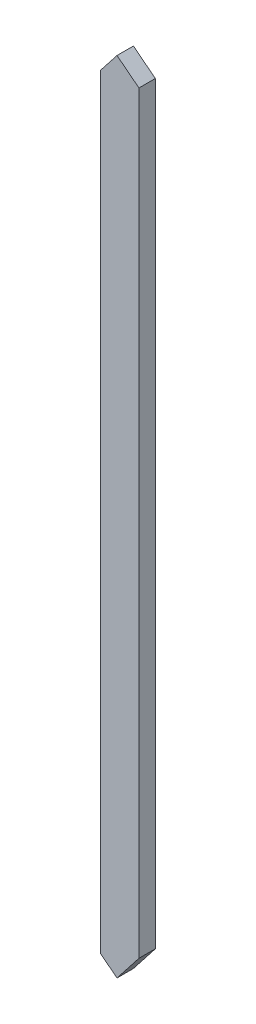
ISO-10303-21;
HEADER;
FILE_DESCRIPTION(('STEP AP214'),'2;1');
FILE_NAME('part.step','',(''),(''),'','','');
FILE_SCHEMA(('AUTOMOTIVE_DESIGN { 1 0 10303 214 1 1 1 1 }'));
ENDSEC;
DATA;
#1=APPLICATION_CONTEXT('core data for automotive mechanical design processes');
#2=APPLICATION_PROTOCOL_DEFINITION('international standard','automotive_design',2000,#1);
#3=PRODUCT_CONTEXT('',#1,'mechanical');
#4=PRODUCT('Part','Part','',(#3));
#5=PRODUCT_RELATED_PRODUCT_CATEGORY('part','',(#4));
#6=PRODUCT_DEFINITION_FORMATION('','',#4);
#7=PRODUCT_DEFINITION_CONTEXT('part definition',#1,'design');
#8=PRODUCT_DEFINITION('design','',#6,#7);
#9=PRODUCT_DEFINITION_SHAPE('','',#8);
#10=(LENGTH_UNIT() NAMED_UNIT(*) SI_UNIT(.MILLI.,.METRE.));
#11=(NAMED_UNIT(*) PLANE_ANGLE_UNIT() SI_UNIT($,.RADIAN.));
#12=(NAMED_UNIT(*) SI_UNIT($,.STERADIAN.) SOLID_ANGLE_UNIT());
#13=UNCERTAINTY_MEASURE_WITH_UNIT(LENGTH_MEASURE(1.E-05),#10,'distance_accuracy_value','');
#14=(GEOMETRIC_REPRESENTATION_CONTEXT(3) GLOBAL_UNCERTAINTY_ASSIGNED_CONTEXT((#13)) GLOBAL_UNIT_ASSIGNED_CONTEXT((#10,
#11,#12)) REPRESENTATION_CONTEXT('',''));
#15=CARTESIAN_POINT('',(0.,0.,0.));
#16=DIRECTION('',(0.,0.,1.));
#17=DIRECTION('',(1.,0.,0.));
#18=AXIS2_PLACEMENT_3D('',#15,#16,#17);
#19=CARTESIAN_POINT('',(-44.45,2032.,19.05));
#20=DIRECTION('',(-1.,0.,0.));
#21=DIRECTION('',(0.,0.,1.));
#22=AXIS2_PLACEMENT_3D('',#19,#20,#21);
#23=PLANE('',#22);
#24=DIRECTION('',(0.,0.,1.));
#25=VECTOR('',#24,1.);
#26=CARTESIAN_POINT('',(-44.4499999999999,29.7359069157097,-19.05));
#27=LINE('',#26,#25);
#28=CARTESIAN_POINT('',(-44.4499999999999,29.7359069157097,-19.05));
#29=VERTEX_POINT('',#28);
#30=CARTESIAN_POINT('',(-44.4499999999999,29.7359069157097,19.05));
#31=VERTEX_POINT('',#30);
#32=EDGE_CURVE('E133',#29,#31,#27,.T.);
#33=ORIENTED_EDGE('',*,*,#32,.T.);
#34=DIRECTION('',(0.,-1.,0.));
#35=VECTOR('',#34,1.);
#36=CARTESIAN_POINT('',(-44.45,2032.,19.05));
#37=LINE('',#36,#35);
#38=CARTESIAN_POINT('',(-44.4499999999999,1806.04110458251,19.05));
#39=VERTEX_POINT('',#38);
#40=EDGE_CURVE('E11',#39,#31,#37,.T.);
#41=ORIENTED_EDGE('',*,*,#40,.F.);
#42=DIRECTION('',(0.,0.,1.));
#43=VECTOR('',#42,1.);
#44=CARTESIAN_POINT('',(-44.4499999999999,1806.04110458251,-19.05));
#45=LINE('',#44,#43);
#46=CARTESIAN_POINT('',(-44.4499999999999,1806.04110458251,-19.05));
#47=VERTEX_POINT('',#46);
#48=EDGE_CURVE('E123',#47,#39,#45,.T.);
#49=ORIENTED_EDGE('',*,*,#48,.F.);
#50=DIRECTION('',(0.,-1.,0.));
#51=VECTOR('',#50,1.);
#52=CARTESIAN_POINT('',(-44.45,2032.,-19.05));
#53=LINE('',#52,#51);
#54=EDGE_CURVE('E45',#47,#29,#53,.T.);
#55=ORIENTED_EDGE('',*,*,#54,.T.);
#56=EDGE_LOOP('',(#33,#41,#49,#55));
#57=FACE_BOUND('',#56,.T.);
#58=ADVANCED_FACE('F42',(#57),#23,.T.);
#59=CARTESIAN_POINT('',(-44.45,2032.,19.05));
#60=DIRECTION('',(0.,0.,-1.));
#61=DIRECTION('',(-1.,0.,0.));
#62=AXIS2_PLACEMENT_3D('',#59,#60,#61);
#63=PLANE('',#62);
#64=ORIENTED_EDGE('',*,*,#40,.T.);
#65=DIRECTION('',(-0.787505001007589,0.616308261658107,0.));
#66=VECTOR('',#65,1.);
#67=CARTESIAN_POINT('',(-6.45411894102008,-1.33643096589253E-11,19.05));
#68=LINE('',#67,#66);
#69=CARTESIAN_POINT('',(-6.45411894102008,-1.33643096589253E-11,19.05));
#70=VERTEX_POINT('',#69);
#71=EDGE_CURVE('E104',#70,#31,#68,.T.);
#72=ORIENTED_EDGE('',*,*,#71,.F.);
#73=DIRECTION('',(-0.616308261658106,-0.787505001007589,0.));
#74=VECTOR('',#73,1.);
#75=CARTESIAN_POINT('',(44.45,65.0441519801796,19.05));
#76=LINE('',#75,#74);
#77=CARTESIAN_POINT('',(44.45,65.0441519801796,19.05));
#78=VERTEX_POINT('',#77);
#79=EDGE_CURVE('E140',#78,#70,#76,.T.);
#80=ORIENTED_EDGE('',*,*,#79,.F.);
#81=DIRECTION('',(0.,-1.,0.));
#82=VECTOR('',#81,1.);
#83=CARTESIAN_POINT('',(44.45,2032.,19.05));
#84=LINE('',#83,#82);
#85=CARTESIAN_POINT('',(44.45,1814.75339091903,19.05));
#86=VERTEX_POINT('',#85);
#87=EDGE_CURVE('E50',#86,#78,#84,.T.);
#88=ORIENTED_EDGE('',*,*,#87,.F.);
#89=DIRECTION('',(-0.787505001007592,0.616308261658103,0.));
#90=VECTOR('',#89,1.);
#91=CARTESIAN_POINT('',(897.666710246745,1147.0185742042,19.05));
#92=LINE('',#91,#90);
#93=CARTESIAN_POINT('',(-6.45411894100911,1854.59139704677,19.05));
#94=VERTEX_POINT('',#93);
#95=EDGE_CURVE('E130',#86,#94,#92,.T.);
#96=ORIENTED_EDGE('',*,*,#95,.T.);
#97=DIRECTION('',(-0.616308261658114,-0.787505001007583,0.));
#98=VECTOR('',#97,1.);
#99=CARTESIAN_POINT('',(-904.12082918776,707.572822842602,19.05));
#100=LINE('',#99,#98);
#101=EDGE_CURVE('E127',#94,#39,#100,.T.);
#102=ORIENTED_EDGE('',*,*,#101,.T.);
#103=EDGE_LOOP('',(#64,#72,#80,#88,#96,#102));
#104=FACE_BOUND('',#103,.T.);
#105=ADVANCED_FACE('F148',(#104),#63,.F.);
#106=CARTESIAN_POINT('',(44.45,2032.,19.05));
#107=DIRECTION('',(-1.,0.,0.));
#108=DIRECTION('',(0.,0.,1.));
#109=AXIS2_PLACEMENT_3D('',#106,#107,#108);
#110=PLANE('',#109);
#111=ORIENTED_EDGE('',*,*,#87,.T.);
#112=DIRECTION('',(0.,0.,1.));
#113=VECTOR('',#112,1.);
#114=CARTESIAN_POINT('',(44.45,65.0441519801796,-19.05));
#115=LINE('',#114,#113);
#116=CARTESIAN_POINT('',(44.45,65.0441519801796,-19.05));
#117=VERTEX_POINT('',#116);
#118=EDGE_CURVE('E99',#117,#78,#115,.T.);
#119=ORIENTED_EDGE('',*,*,#118,.F.);
#120=DIRECTION('',(0.,-1.,0.));
#121=VECTOR('',#120,1.);
#122=CARTESIAN_POINT('',(44.45,2032.,-19.05));
#123=LINE('',#122,#121);
#124=CARTESIAN_POINT('',(44.45,1814.75339091903,-19.05));
#125=VERTEX_POINT('',#124);
#126=EDGE_CURVE('E111',#125,#117,#123,.T.);
#127=ORIENTED_EDGE('',*,*,#126,.F.);
#128=DIRECTION('',(0.,0.,1.));
#129=VECTOR('',#128,1.);
#130=CARTESIAN_POINT('',(44.45,1814.75339091903,-19.05));
#131=LINE('',#130,#129);
#132=EDGE_CURVE('E121',#125,#86,#131,.T.);
#133=ORIENTED_EDGE('',*,*,#132,.T.);
#134=EDGE_LOOP('',(#111,#119,#127,#133));
#135=FACE_BOUND('',#134,.T.);
#136=ADVANCED_FACE('F109',(#135),#110,.F.);
#137=CARTESIAN_POINT('',(-44.45,2032.,-19.05));
#138=DIRECTION('',(0.,0.,-1.));
#139=DIRECTION('',(-1.,0.,0.));
#140=AXIS2_PLACEMENT_3D('',#137,#138,#139);
#141=PLANE('',#140);
#142=DIRECTION('',(-0.787505001007589,0.616308261658107,0.));
#143=VECTOR('',#142,1.);
#144=CARTESIAN_POINT('',(-6.45411894102008,-1.33643096589253E-11,-19.05));
#145=LINE('',#144,#143);
#146=CARTESIAN_POINT('',(-6.45411894100961,0.,-19.05));
#147=VERTEX_POINT('',#146);
#148=EDGE_CURVE('E58',#147,#29,#145,.T.);
#149=ORIENTED_EDGE('',*,*,#148,.T.);
#150=ORIENTED_EDGE('',*,*,#54,.F.);
#151=DIRECTION('',(-0.616308261658114,-0.787505001007583,0.));
#152=VECTOR('',#151,1.);
#153=CARTESIAN_POINT('',(-904.12082918776,707.572822842602,-19.05));
#154=LINE('',#153,#152);
#155=CARTESIAN_POINT('',(-6.45411894100913,1854.59139704677,-19.05));
#156=VERTEX_POINT('',#155);
#157=EDGE_CURVE('E124',#156,#47,#154,.T.);
#158=ORIENTED_EDGE('',*,*,#157,.F.);
#159=DIRECTION('',(-0.787505001007592,0.616308261658103,0.));
#160=VECTOR('',#159,1.);
#161=CARTESIAN_POINT('',(897.666710246745,1147.0185742042,-19.05));
#162=LINE('',#161,#160);
#163=EDGE_CURVE('E117',#125,#156,#162,.T.);
#164=ORIENTED_EDGE('',*,*,#163,.F.);
#165=ORIENTED_EDGE('',*,*,#126,.T.);
#166=DIRECTION('',(-0.616308261658106,-0.787505001007589,0.));
#167=VECTOR('',#166,1.);
#168=CARTESIAN_POINT('',(44.45,65.0441519801796,-19.05));
#169=LINE('',#168,#167);
#170=EDGE_CURVE('E95',#117,#147,#169,.T.);
#171=ORIENTED_EDGE('',*,*,#170,.T.);
#172=EDGE_LOOP('',(#149,#150,#158,#164,#165,#171));
#173=FACE_BOUND('',#172,.T.);
#174=ADVANCED_FACE('F115',(#173),#141,.T.);
#175=CARTESIAN_POINT('',(897.666710246745,1147.0185742042,-19.05));
#176=DIRECTION('',(0.616308261658103,0.787505001007592,0.));
#177=DIRECTION('',(-0.787505001007592,0.616308261658103,0.));
#178=AXIS2_PLACEMENT_3D('',#175,#176,#177);
#179=PLANE('',#178);
#180=ORIENTED_EDGE('',*,*,#95,.F.);
#181=ORIENTED_EDGE('',*,*,#132,.F.);
#182=ORIENTED_EDGE('',*,*,#163,.T.);
#183=DIRECTION('',(0.,0.,1.));
#184=VECTOR('',#183,1.);
#185=CARTESIAN_POINT('',(-6.45411894100911,1854.59139704677,-19.05));
#186=LINE('',#185,#184);
#187=EDGE_CURVE('E66',#156,#94,#186,.T.);
#188=ORIENTED_EDGE('',*,*,#187,.T.);
#189=EDGE_LOOP('',(#180,#181,#182,#188));
#190=FACE_BOUND('',#189,.T.);
#191=ADVANCED_FACE('F151',(#190),#179,.T.);
#192=CARTESIAN_POINT('',(-904.12082918776,707.572822842602,-19.05));
#193=DIRECTION('',(-0.787505001007583,0.616308261658114,0.));
#194=DIRECTION('',(-0.616308261658114,-0.787505001007583,0.));
#195=AXIS2_PLACEMENT_3D('',#192,#193,#194);
#196=PLANE('',#195);
#197=ORIENTED_EDGE('',*,*,#101,.F.);
#198=ORIENTED_EDGE('',*,*,#187,.F.);
#199=ORIENTED_EDGE('',*,*,#157,.T.);
#200=ORIENTED_EDGE('',*,*,#48,.T.);
#201=EDGE_LOOP('',(#197,#198,#199,#200));
#202=FACE_BOUND('',#201,.T.);
#203=ADVANCED_FACE('F146',(#202),#196,.T.);
#204=CARTESIAN_POINT('',(-6.45411894102008,-1.33643096589253E-11,-19.05));
#205=DIRECTION('',(0.616308261658107,0.787505001007589,0.));
#206=DIRECTION('',(-0.787505001007589,0.616308261658107,0.));
#207=AXIS2_PLACEMENT_3D('',#204,#205,#206);
#208=PLANE('',#207);
#209=ORIENTED_EDGE('',*,*,#71,.T.);
#210=ORIENTED_EDGE('',*,*,#32,.F.);
#211=ORIENTED_EDGE('',*,*,#148,.F.);
#212=DIRECTION('',(0.,0.,1.));
#213=VECTOR('',#212,1.);
#214=CARTESIAN_POINT('',(-6.45411894102008,-1.33643096589253E-11,-19.05));
#215=LINE('',#214,#213);
#216=EDGE_CURVE('E101',#147,#70,#215,.T.);
#217=ORIENTED_EDGE('',*,*,#216,.T.);
#218=EDGE_LOOP('',(#209,#210,#211,#217));
#219=FACE_BOUND('',#218,.T.);
#220=ADVANCED_FACE('F158',(#219),#208,.F.);
#221=CARTESIAN_POINT('',(44.45,65.0441519801796,-19.05));
#222=DIRECTION('',(-0.787505001007589,0.616308261658106,0.));
#223=DIRECTION('',(-0.616308261658106,-0.787505001007589,0.));
#224=AXIS2_PLACEMENT_3D('',#221,#222,#223);
#225=PLANE('',#224);
#226=ORIENTED_EDGE('',*,*,#79,.T.);
#227=ORIENTED_EDGE('',*,*,#216,.F.);
#228=ORIENTED_EDGE('',*,*,#170,.F.);
#229=ORIENTED_EDGE('',*,*,#118,.T.);
#230=EDGE_LOOP('',(#226,#227,#228,#229));
#231=FACE_BOUND('',#230,.T.);
#232=ADVANCED_FACE('F98',(#231),#225,.F.);
#233=CLOSED_SHELL('',(#58,#105,#136,#174,#191,#203,#220,#232));
#234=MANIFOLD_SOLID_BREP('B2',#233);
#235=ADVANCED_BREP_SHAPE_REPRESENTATION('',(#18,#234),#14);
#236=SHAPE_DEFINITION_REPRESENTATION(#9,#235);
ENDSEC;
END-ISO-10303-21;
